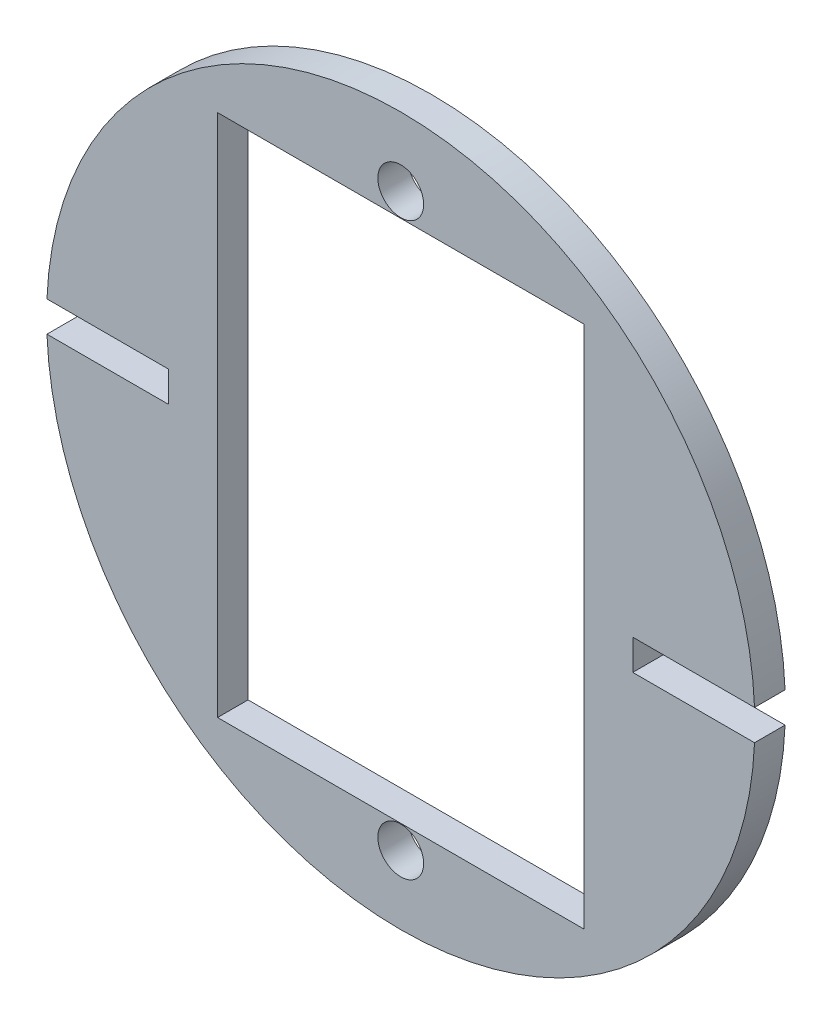
ISO-10303-21;
HEADER;
FILE_DESCRIPTION(('STEP AP214'),'2;1');
FILE_NAME('part.step','',(''),(''),'','','');
FILE_SCHEMA(('AUTOMOTIVE_DESIGN { 1 0 10303 214 1 1 1 1 }'));
ENDSEC;
DATA;
#1=APPLICATION_CONTEXT('core data for automotive mechanical design processes');
#2=APPLICATION_PROTOCOL_DEFINITION('international standard','automotive_design',2000,#1);
#3=PRODUCT_CONTEXT('',#1,'mechanical');
#4=PRODUCT('Part','Part','',(#3));
#5=PRODUCT_RELATED_PRODUCT_CATEGORY('part','',(#4));
#6=PRODUCT_DEFINITION_FORMATION('','',#4);
#7=PRODUCT_DEFINITION_CONTEXT('part definition',#1,'design');
#8=PRODUCT_DEFINITION('design','',#6,#7);
#9=PRODUCT_DEFINITION_SHAPE('','',#8);
#10=(LENGTH_UNIT() NAMED_UNIT(*) SI_UNIT(.MILLI.,.METRE.));
#11=(NAMED_UNIT(*) PLANE_ANGLE_UNIT() SI_UNIT($,.RADIAN.));
#12=(NAMED_UNIT(*) SI_UNIT($,.STERADIAN.) SOLID_ANGLE_UNIT());
#13=UNCERTAINTY_MEASURE_WITH_UNIT(LENGTH_MEASURE(1.E-05),#10,'distance_accuracy_value','');
#14=(GEOMETRIC_REPRESENTATION_CONTEXT(3) GLOBAL_UNCERTAINTY_ASSIGNED_CONTEXT((#13)) GLOBAL_UNIT_ASSIGNED_CONTEXT((#10,
#11,#12)) REPRESENTATION_CONTEXT('',''));
#15=CARTESIAN_POINT('',(0.,0.,0.));
#16=DIRECTION('',(0.,0.,1.));
#17=DIRECTION('',(1.,0.,0.));
#18=AXIS2_PLACEMENT_3D('',#15,#16,#17);
#19=CARTESIAN_POINT('',(0.,0.,6.35));
#20=DIRECTION('',(0.,0.,1.));
#21=DIRECTION('',(1.,0.,0.));
#22=AXIS2_PLACEMENT_3D('',#19,#20,#21);
#23=PLANE('',#22);
#24=DIRECTION('',(-1.,0.,0.));
#25=VECTOR('',#24,1.);
#26=CARTESIAN_POINT('',(38.1,-54.483,6.35));
#27=LINE('',#26,#25);
#28=CARTESIAN_POINT('',(38.1,-54.483,6.35));
#29=VERTEX_POINT('',#28);
#30=CARTESIAN_POINT('',(-38.1,-54.483,6.35));
#31=VERTEX_POINT('',#30);
#32=EDGE_CURVE('E142',#29,#31,#27,.T.);
#33=ORIENTED_EDGE('',*,*,#32,.T.);
#34=DIRECTION('',(0.,1.,0.));
#35=VECTOR('',#34,1.);
#36=CARTESIAN_POINT('',(-38.1,54.483,6.35));
#37=LINE('',#36,#35);
#38=CARTESIAN_POINT('',(-38.1,54.483,6.35));
#39=VERTEX_POINT('',#38);
#40=EDGE_CURVE('E152',#31,#39,#37,.T.);
#41=ORIENTED_EDGE('',*,*,#40,.T.);
#42=DIRECTION('',(1.,0.,0.));
#43=VECTOR('',#42,1.);
#44=CARTESIAN_POINT('',(38.1,54.483,6.35));
#45=LINE('',#44,#43);
#46=CARTESIAN_POINT('',(38.1,54.483,6.35));
#47=VERTEX_POINT('',#46);
#48=EDGE_CURVE('E66',#39,#47,#45,.T.);
#49=ORIENTED_EDGE('',*,*,#48,.T.);
#50=DIRECTION('',(0.,-1.,0.));
#51=VECTOR('',#50,1.);
#52=CARTESIAN_POINT('',(38.1,54.483,6.35));
#53=LINE('',#52,#51);
#54=EDGE_CURVE('E149',#47,#29,#53,.T.);
#55=ORIENTED_EDGE('',*,*,#54,.T.);
#56=EDGE_LOOP('',(#33,#41,#49,#55));
#57=FACE_BOUND('',#56,.T.);
#58=CARTESIAN_POINT('',(0.,59.3725,6.35));
#59=DIRECTION('',(0.,0.,-1.));
#60=DIRECTION('',(-1.,0.,0.));
#61=AXIS2_PLACEMENT_3D('',#58,#59,#60);
#62=CIRCLE('',#61,4.7625);
#63=CARTESIAN_POINT('',(-4.7625,59.3725,6.35));
#64=VERTEX_POINT('',#63);
#65=EDGE_CURVE('E182',#64,#64,#62,.F.);
#66=ORIENTED_EDGE('',*,*,#65,.F.);
#67=EDGE_LOOP('',(#66));
#68=FACE_BOUND('',#67,.T.);
#69=DIRECTION('',(-1.,0.,0.));
#70=VECTOR('',#69,1.);
#71=CARTESIAN_POINT('',(76.2,-3.17500000000001,6.35));
#72=LINE('',#71,#70);
#73=CARTESIAN_POINT('',(73.5915414636764,-3.17500000000001,6.35));
#74=VERTEX_POINT('',#73);
#75=CARTESIAN_POINT('',(48.26,-3.17500000000001,6.35));
#76=VERTEX_POINT('',#75);
#77=EDGE_CURVE('E213',#74,#76,#72,.T.);
#78=ORIENTED_EDGE('',*,*,#77,.T.);
#79=DIRECTION('',(0.,1.,0.));
#80=VECTOR('',#79,1.);
#81=CARTESIAN_POINT('',(48.26,-3.17500000000001,6.35));
#82=LINE('',#81,#80);
#83=CARTESIAN_POINT('',(48.26,3.175,6.35));
#84=VERTEX_POINT('',#83);
#85=EDGE_CURVE('E204',#76,#84,#82,.T.);
#86=ORIENTED_EDGE('',*,*,#85,.T.);
#87=DIRECTION('',(1.,0.,0.));
#88=VECTOR('',#87,1.);
#89=CARTESIAN_POINT('',(48.26,3.175,6.35));
#90=LINE('',#89,#88);
#91=CARTESIAN_POINT('',(73.5915414636764,3.17499999999999,6.35));
#92=VERTEX_POINT('',#91);
#93=EDGE_CURVE('E208',#84,#92,#90,.T.);
#94=ORIENTED_EDGE('',*,*,#93,.T.);
#95=CARTESIAN_POINT('',(0.,0.,6.35));
#96=DIRECTION('',(0.,0.,1.));
#97=DIRECTION('',(1.,0.,0.));
#98=AXIS2_PLACEMENT_3D('',#95,#96,#97);
#99=CIRCLE('',#98,73.66);
#100=CARTESIAN_POINT('',(-73.5915414636764,3.17500000000001,6.35));
#101=VERTEX_POINT('',#100);
#102=EDGE_CURVE('E271',#92,#101,#99,.T.);
#103=ORIENTED_EDGE('',*,*,#102,.T.);
#104=DIRECTION('',(1.,0.,0.));
#105=VECTOR('',#104,1.);
#106=CARTESIAN_POINT('',(-48.26,3.17500000000001,6.35));
#107=LINE('',#106,#105);
#108=CARTESIAN_POINT('',(-48.26,3.17500000000001,6.35));
#109=VERTEX_POINT('',#108);
#110=EDGE_CURVE('E248',#101,#109,#107,.T.);
#111=ORIENTED_EDGE('',*,*,#110,.T.);
#112=DIRECTION('',(0.,-1.,0.));
#113=VECTOR('',#112,1.);
#114=CARTESIAN_POINT('',(-48.26,0.,6.35));
#115=LINE('',#114,#113);
#116=CARTESIAN_POINT('',(-48.26,-3.175,6.35));
#117=VERTEX_POINT('',#116);
#118=EDGE_CURVE('E235',#109,#117,#115,.T.);
#119=ORIENTED_EDGE('',*,*,#118,.T.);
#120=DIRECTION('',(-1.,0.,0.));
#121=VECTOR('',#120,1.);
#122=CARTESIAN_POINT('',(-76.2,-3.17499999999999,6.35));
#123=LINE('',#122,#121);
#124=CARTESIAN_POINT('',(-73.5915414636764,-3.17499999999999,6.35));
#125=VERTEX_POINT('',#124);
#126=EDGE_CURVE('E242',#117,#125,#123,.T.);
#127=ORIENTED_EDGE('',*,*,#126,.T.);
#128=EDGE_CURVE('E275',#125,#74,#99,.T.);
#129=ORIENTED_EDGE('',*,*,#128,.T.);
#130=EDGE_LOOP('',(#78,#86,#94,#103,#111,#119,#127,#129));
#131=FACE_BOUND('',#130,.T.);
#132=CARTESIAN_POINT('',(0.,-59.3725,6.35));
#133=DIRECTION('',(0.,0.,-1.));
#134=DIRECTION('',(-1.,0.,0.));
#135=AXIS2_PLACEMENT_3D('',#132,#133,#134);
#136=CIRCLE('',#135,4.7625);
#137=CARTESIAN_POINT('',(-4.7625,-59.3725,6.35));
#138=VERTEX_POINT('',#137);
#139=EDGE_CURVE('E188',#138,#138,#136,.T.);
#140=ORIENTED_EDGE('',*,*,#139,.T.);
#141=EDGE_LOOP('',(#140));
#142=FACE_BOUND('',#141,.T.);
#143=ADVANCED_FACE('F50',(#57,#68,#131,#142),#23,.T.);
#144=CARTESIAN_POINT('',(0.,0.,0.));
#145=DIRECTION('',(0.,0.,1.));
#146=DIRECTION('',(1.,0.,0.));
#147=AXIS2_PLACEMENT_3D('',#144,#145,#146);
#148=PLANE('',#147);
#149=DIRECTION('',(0.,1.,0.));
#150=VECTOR('',#149,1.);
#151=CARTESIAN_POINT('',(-38.1,54.483,0.));
#152=LINE('',#151,#150);
#153=CARTESIAN_POINT('',(-38.1,-54.483,0.));
#154=VERTEX_POINT('',#153);
#155=CARTESIAN_POINT('',(-38.1,54.483,0.));
#156=VERTEX_POINT('',#155);
#157=EDGE_CURVE('E173',#154,#156,#152,.T.);
#158=ORIENTED_EDGE('',*,*,#157,.F.);
#159=DIRECTION('',(-1.,0.,0.));
#160=VECTOR('',#159,1.);
#161=CARTESIAN_POINT('',(38.1,-54.483,0.));
#162=LINE('',#161,#160);
#163=CARTESIAN_POINT('',(38.1,-54.483,0.));
#164=VERTEX_POINT('',#163);
#165=EDGE_CURVE('E74',#164,#154,#162,.T.);
#166=ORIENTED_EDGE('',*,*,#165,.F.);
#167=DIRECTION('',(0.,-1.,0.));
#168=VECTOR('',#167,1.);
#169=CARTESIAN_POINT('',(38.1,54.483,0.));
#170=LINE('',#169,#168);
#171=CARTESIAN_POINT('',(38.1,54.483,0.));
#172=VERTEX_POINT('',#171);
#173=EDGE_CURVE('E160',#172,#164,#170,.T.);
#174=ORIENTED_EDGE('',*,*,#173,.F.);
#175=DIRECTION('',(1.,0.,0.));
#176=VECTOR('',#175,1.);
#177=CARTESIAN_POINT('',(38.1,54.483,0.));
#178=LINE('',#177,#176);
#179=EDGE_CURVE('E164',#156,#172,#178,.T.);
#180=ORIENTED_EDGE('',*,*,#179,.F.);
#181=EDGE_LOOP('',(#158,#166,#174,#180));
#182=FACE_BOUND('',#181,.T.);
#183=DIRECTION('',(0.,1.,0.));
#184=VECTOR('',#183,1.);
#185=CARTESIAN_POINT('',(48.26,0.,0.));
#186=LINE('',#185,#184);
#187=CARTESIAN_POINT('',(48.26,-3.17500000000001,0.));
#188=VERTEX_POINT('',#187);
#189=CARTESIAN_POINT('',(48.26,3.175,0.));
#190=VERTEX_POINT('',#189);
#191=EDGE_CURVE('E218',#188,#190,#186,.T.);
#192=ORIENTED_EDGE('',*,*,#191,.F.);
#193=DIRECTION('',(1.,0.,0.));
#194=VECTOR('',#193,1.);
#195=CARTESIAN_POINT('',(0.,-3.17500000000001,0.));
#196=LINE('',#195,#194);
#197=CARTESIAN_POINT('',(73.5915414636764,-3.17500000000001,0.));
#198=VERTEX_POINT('',#197);
#199=EDGE_CURVE('E12',#188,#198,#196,.T.);
#200=ORIENTED_EDGE('',*,*,#199,.T.);
#201=CARTESIAN_POINT('',(0.,0.,0.));
#202=DIRECTION('',(0.,0.,1.));
#203=DIRECTION('',(1.,0.,0.));
#204=AXIS2_PLACEMENT_3D('',#201,#202,#203);
#205=CIRCLE('',#204,73.66);
#206=CARTESIAN_POINT('',(-73.5915414636764,-3.17499999999999,0.));
#207=VERTEX_POINT('',#206);
#208=EDGE_CURVE('E270',#207,#198,#205,.T.);
#209=ORIENTED_EDGE('',*,*,#208,.F.);
#210=DIRECTION('',(-1.,0.,0.));
#211=VECTOR('',#210,1.);
#212=CARTESIAN_POINT('',(-76.2,-3.17499999999999,0.));
#213=LINE('',#212,#211);
#214=CARTESIAN_POINT('',(-48.26,-3.175,0.));
#215=VERTEX_POINT('',#214);
#216=EDGE_CURVE('E222',#215,#207,#213,.T.);
#217=ORIENTED_EDGE('',*,*,#216,.F.);
#218=DIRECTION('',(0.,-1.,0.));
#219=VECTOR('',#218,1.);
#220=CARTESIAN_POINT('',(-48.26,-3.175,0.));
#221=LINE('',#220,#219);
#222=CARTESIAN_POINT('',(-48.26,3.17500000000001,0.));
#223=VERTEX_POINT('',#222);
#224=EDGE_CURVE('E238',#223,#215,#221,.T.);
#225=ORIENTED_EDGE('',*,*,#224,.F.);
#226=DIRECTION('',(-1.,0.,0.));
#227=VECTOR('',#226,1.);
#228=CARTESIAN_POINT('',(0.,3.175,0.));
#229=LINE('',#228,#227);
#230=CARTESIAN_POINT('',(-73.5915414636764,3.17500000000001,0.));
#231=VERTEX_POINT('',#230);
#232=EDGE_CURVE('E59',#223,#231,#229,.T.);
#233=ORIENTED_EDGE('',*,*,#232,.T.);
#234=CARTESIAN_POINT('',(73.5915414636764,3.17499999999999,0.));
#235=VERTEX_POINT('',#234);
#236=EDGE_CURVE('E276',#235,#231,#205,.T.);
#237=ORIENTED_EDGE('',*,*,#236,.F.);
#238=DIRECTION('',(1.,0.,0.));
#239=VECTOR('',#238,1.);
#240=CARTESIAN_POINT('',(48.26,3.175,0.));
#241=LINE('',#240,#239);
#242=EDGE_CURVE('E209',#190,#235,#241,.T.);
#243=ORIENTED_EDGE('',*,*,#242,.F.);
#244=EDGE_LOOP('',(#192,#200,#209,#217,#225,#233,#237,#243));
#245=FACE_BOUND('',#244,.T.);
#246=CARTESIAN_POINT('',(0.,59.3725,0.));
#247=DIRECTION('',(0.,0.,-1.));
#248=DIRECTION('',(-1.,0.,0.));
#249=AXIS2_PLACEMENT_3D('',#246,#247,#248);
#250=CIRCLE('',#249,4.7625);
#251=CARTESIAN_POINT('',(-4.7625,59.3725,0.));
#252=VERTEX_POINT('',#251);
#253=EDGE_CURVE('E197',#252,#252,#250,.F.);
#254=ORIENTED_EDGE('',*,*,#253,.T.);
#255=EDGE_LOOP('',(#254));
#256=FACE_BOUND('',#255,.T.);
#257=CARTESIAN_POINT('',(0.,-59.3725,0.));
#258=DIRECTION('',(0.,0.,-1.));
#259=DIRECTION('',(-1.,0.,0.));
#260=AXIS2_PLACEMENT_3D('',#257,#258,#259);
#261=CIRCLE('',#260,4.7625);
#262=CARTESIAN_POINT('',(-4.7625,-59.3725,0.));
#263=VERTEX_POINT('',#262);
#264=EDGE_CURVE('E193',#263,#263,#261,.T.);
#265=ORIENTED_EDGE('',*,*,#264,.F.);
#266=EDGE_LOOP('',(#265));
#267=FACE_BOUND('',#266,.T.);
#268=ADVANCED_FACE('F285',(#182,#245,#256,#267),#148,.F.);
#269=CARTESIAN_POINT('',(0.,0.,6.35));
#270=DIRECTION('',(0.,0.,-1.));
#271=DIRECTION('',(-1.,0.,0.));
#272=AXIS2_PLACEMENT_3D('',#269,#270,#271);
#273=CYLINDRICAL_SURFACE('',#272,73.66);
#274=ORIENTED_EDGE('',*,*,#208,.T.);
#275=DIRECTION('',(0.,0.,-1.));
#276=VECTOR('',#275,1.);
#277=CARTESIAN_POINT('',(73.5915414636764,-3.17500000000001,6.35));
#278=LINE('',#277,#276);
#279=EDGE_CURVE('E266',#198,#74,#278,.F.);
#280=ORIENTED_EDGE('',*,*,#279,.T.);
#281=ORIENTED_EDGE('',*,*,#128,.F.);
#282=DIRECTION('',(0.,0.,-1.));
#283=VECTOR('',#282,1.);
#284=CARTESIAN_POINT('',(-73.5915414636764,-3.17499999999999,6.35));
#285=LINE('',#284,#283);
#286=EDGE_CURVE('E258',#125,#207,#285,.T.);
#287=ORIENTED_EDGE('',*,*,#286,.T.);
#288=EDGE_LOOP('',(#274,#280,#281,#287));
#289=FACE_BOUND('',#288,.T.);
#290=ADVANCED_FACE('F306',(#289),#273,.T.);
#291=ORIENTED_EDGE('',*,*,#102,.F.);
#292=DIRECTION('',(0.,0.,-1.));
#293=VECTOR('',#292,1.);
#294=CARTESIAN_POINT('',(73.5915414636764,3.17499999999999,6.35));
#295=LINE('',#294,#293);
#296=EDGE_CURVE('E262',#92,#235,#295,.T.);
#297=ORIENTED_EDGE('',*,*,#296,.T.);
#298=ORIENTED_EDGE('',*,*,#236,.T.);
#299=DIRECTION('',(0.,0.,-1.));
#300=VECTOR('',#299,1.);
#301=CARTESIAN_POINT('',(-73.5915414636764,3.17500000000001,6.35));
#302=LINE('',#301,#300);
#303=EDGE_CURVE('E228',#231,#101,#302,.F.);
#304=ORIENTED_EDGE('',*,*,#303,.T.);
#305=EDGE_LOOP('',(#291,#297,#298,#304));
#306=FACE_BOUND('',#305,.T.);
#307=ADVANCED_FACE('F52',(#306),#273,.T.);
#308=CARTESIAN_POINT('',(-76.2,-3.17499999999999,6.35));
#309=DIRECTION('',(0.,-1.,0.));
#310=DIRECTION('',(1.,0.,0.));
#311=AXIS2_PLACEMENT_3D('',#308,#309,#310);
#312=PLANE('',#311);
#313=ORIENTED_EDGE('',*,*,#126,.F.);
#314=DIRECTION('',(0.,0.,-1.));
#315=VECTOR('',#314,1.);
#316=CARTESIAN_POINT('',(-48.26,-3.175,6.35));
#317=LINE('',#316,#315);
#318=EDGE_CURVE('E192',#117,#215,#317,.T.);
#319=ORIENTED_EDGE('',*,*,#318,.T.);
#320=ORIENTED_EDGE('',*,*,#216,.T.);
#321=ORIENTED_EDGE('',*,*,#286,.F.);
#322=EDGE_LOOP('',(#313,#319,#320,#321));
#323=FACE_BOUND('',#322,.T.);
#324=ADVANCED_FACE('F313',(#323),#312,.F.);
#325=CARTESIAN_POINT('',(-48.26,3.17500000000001,6.35));
#326=DIRECTION('',(0.,1.,0.));
#327=DIRECTION('',(-1.,0.,0.));
#328=AXIS2_PLACEMENT_3D('',#325,#326,#327);
#329=PLANE('',#328);
#330=ORIENTED_EDGE('',*,*,#232,.F.);
#331=DIRECTION('',(0.,0.,-1.));
#332=VECTOR('',#331,1.);
#333=CARTESIAN_POINT('',(-48.26,3.17500000000001,6.35));
#334=LINE('',#333,#332);
#335=EDGE_CURVE('E231',#109,#223,#334,.T.);
#336=ORIENTED_EDGE('',*,*,#335,.F.);
#337=ORIENTED_EDGE('',*,*,#110,.F.);
#338=ORIENTED_EDGE('',*,*,#303,.F.);
#339=EDGE_LOOP('',(#330,#336,#337,#338));
#340=FACE_BOUND('',#339,.T.);
#341=ADVANCED_FACE('F316',(#340),#329,.F.);
#342=CARTESIAN_POINT('',(-48.26,-3.175,6.35));
#343=DIRECTION('',(1.,0.,0.));
#344=DIRECTION('',(0.,0.,-1.));
#345=AXIS2_PLACEMENT_3D('',#342,#343,#344);
#346=PLANE('',#345);
#347=ORIENTED_EDGE('',*,*,#224,.T.);
#348=ORIENTED_EDGE('',*,*,#318,.F.);
#349=ORIENTED_EDGE('',*,*,#118,.F.);
#350=ORIENTED_EDGE('',*,*,#335,.T.);
#351=EDGE_LOOP('',(#347,#348,#349,#350));
#352=FACE_BOUND('',#351,.T.);
#353=ADVANCED_FACE('F315',(#352),#346,.F.);
#354=CARTESIAN_POINT('',(76.2,-3.17500000000001,6.35));
#355=DIRECTION('',(0.,-1.,0.));
#356=DIRECTION('',(0.,0.,-1.));
#357=AXIS2_PLACEMENT_3D('',#354,#355,#356);
#358=PLANE('',#357);
#359=ORIENTED_EDGE('',*,*,#199,.F.);
#360=DIRECTION('',(0.,0.,-1.));
#361=VECTOR('',#360,1.);
#362=CARTESIAN_POINT('',(48.26,-3.17500000000001,6.35));
#363=LINE('',#362,#361);
#364=EDGE_CURVE('E225',#76,#188,#363,.T.);
#365=ORIENTED_EDGE('',*,*,#364,.F.);
#366=ORIENTED_EDGE('',*,*,#77,.F.);
#367=ORIENTED_EDGE('',*,*,#279,.F.);
#368=EDGE_LOOP('',(#359,#365,#366,#367));
#369=FACE_BOUND('',#368,.T.);
#370=ADVANCED_FACE('F323',(#369),#358,.F.);
#371=CARTESIAN_POINT('',(48.26,3.175,6.35));
#372=DIRECTION('',(0.,1.,0.));
#373=DIRECTION('',(-1.,0.,0.));
#374=AXIS2_PLACEMENT_3D('',#371,#372,#373);
#375=PLANE('',#374);
#376=ORIENTED_EDGE('',*,*,#93,.F.);
#377=DIRECTION('',(0.,0.,-1.));
#378=VECTOR('',#377,1.);
#379=CARTESIAN_POINT('',(48.26,3.175,6.35));
#380=LINE('',#379,#378);
#381=EDGE_CURVE('E217',#84,#190,#380,.T.);
#382=ORIENTED_EDGE('',*,*,#381,.T.);
#383=ORIENTED_EDGE('',*,*,#242,.T.);
#384=ORIENTED_EDGE('',*,*,#296,.F.);
#385=EDGE_LOOP('',(#376,#382,#383,#384));
#386=FACE_BOUND('',#385,.T.);
#387=ADVANCED_FACE('F294',(#386),#375,.F.);
#388=CARTESIAN_POINT('',(48.26,0.,6.35));
#389=DIRECTION('',(-1.,0.,0.));
#390=DIRECTION('',(0.,0.,1.));
#391=AXIS2_PLACEMENT_3D('',#388,#389,#390);
#392=PLANE('',#391);
#393=ORIENTED_EDGE('',*,*,#191,.T.);
#394=ORIENTED_EDGE('',*,*,#381,.F.);
#395=ORIENTED_EDGE('',*,*,#85,.F.);
#396=ORIENTED_EDGE('',*,*,#364,.T.);
#397=EDGE_LOOP('',(#393,#394,#395,#396));
#398=FACE_BOUND('',#397,.T.);
#399=ADVANCED_FACE('F300',(#398),#392,.F.);
#400=CARTESIAN_POINT('',(0.,59.3725,6.35));
#401=DIRECTION('',(0.,0.,-1.));
#402=DIRECTION('',(-1.,0.,0.));
#403=AXIS2_PLACEMENT_3D('',#400,#401,#402);
#404=CYLINDRICAL_SURFACE('',#403,4.7625);
#405=ORIENTED_EDGE('',*,*,#65,.T.);
#406=EDGE_LOOP('',(#405));
#407=FACE_BOUND('',#406,.T.);
#408=ORIENTED_EDGE('',*,*,#253,.F.);
#409=EDGE_LOOP('',(#408));
#410=FACE_BOUND('',#409,.T.);
#411=ADVANCED_FACE('F354',(#407,#410),#404,.F.);
#412=CARTESIAN_POINT('',(0.,-59.3725,6.35));
#413=DIRECTION('',(0.,0.,-1.));
#414=DIRECTION('',(-1.,0.,0.));
#415=AXIS2_PLACEMENT_3D('',#412,#413,#414);
#416=CYLINDRICAL_SURFACE('',#415,4.7625);
#417=ORIENTED_EDGE('',*,*,#139,.F.);
#418=EDGE_LOOP('',(#417));
#419=FACE_BOUND('',#418,.T.);
#420=ORIENTED_EDGE('',*,*,#264,.T.);
#421=EDGE_LOOP('',(#420));
#422=FACE_BOUND('',#421,.T.);
#423=ADVANCED_FACE('F348',(#419,#422),#416,.F.);
#424=CARTESIAN_POINT('',(38.1,-54.483,6.35));
#425=DIRECTION('',(0.,-1.,0.));
#426=DIRECTION('',(0.,0.,-1.));
#427=AXIS2_PLACEMENT_3D('',#424,#425,#426);
#428=PLANE('',#427);
#429=ORIENTED_EDGE('',*,*,#165,.T.);
#430=DIRECTION('',(0.,0.,-1.));
#431=VECTOR('',#430,1.);
#432=CARTESIAN_POINT('',(-38.1,-54.483,6.35));
#433=LINE('',#432,#431);
#434=EDGE_CURVE('E138',#31,#154,#433,.T.);
#435=ORIENTED_EDGE('',*,*,#434,.F.);
#436=ORIENTED_EDGE('',*,*,#32,.F.);
#437=DIRECTION('',(0.,0.,-1.));
#438=VECTOR('',#437,1.);
#439=CARTESIAN_POINT('',(38.1,-54.483,6.35));
#440=LINE('',#439,#438);
#441=EDGE_CURVE('E179',#29,#164,#440,.T.);
#442=ORIENTED_EDGE('',*,*,#441,.T.);
#443=EDGE_LOOP('',(#429,#435,#436,#442));
#444=FACE_BOUND('',#443,.T.);
#445=ADVANCED_FACE('F140',(#444),#428,.F.);
#446=CARTESIAN_POINT('',(38.1,54.483,6.35));
#447=DIRECTION('',(1.,0.,0.));
#448=DIRECTION('',(0.,0.,-1.));
#449=AXIS2_PLACEMENT_3D('',#446,#447,#448);
#450=PLANE('',#449);
#451=ORIENTED_EDGE('',*,*,#173,.T.);
#452=ORIENTED_EDGE('',*,*,#441,.F.);
#453=ORIENTED_EDGE('',*,*,#54,.F.);
#454=DIRECTION('',(0.,0.,-1.));
#455=VECTOR('',#454,1.);
#456=CARTESIAN_POINT('',(38.1,54.483,6.35));
#457=LINE('',#456,#455);
#458=EDGE_CURVE('E183',#47,#172,#457,.T.);
#459=ORIENTED_EDGE('',*,*,#458,.T.);
#460=EDGE_LOOP('',(#451,#452,#453,#459));
#461=FACE_BOUND('',#460,.T.);
#462=ADVANCED_FACE('F341',(#461),#450,.F.);
#463=CARTESIAN_POINT('',(38.1,54.483,6.35));
#464=DIRECTION('',(0.,1.,0.));
#465=DIRECTION('',(0.,0.,1.));
#466=AXIS2_PLACEMENT_3D('',#463,#464,#465);
#467=PLANE('',#466);
#468=ORIENTED_EDGE('',*,*,#179,.T.);
#469=ORIENTED_EDGE('',*,*,#458,.F.);
#470=ORIENTED_EDGE('',*,*,#48,.F.);
#471=DIRECTION('',(0.,0.,-1.));
#472=VECTOR('',#471,1.);
#473=CARTESIAN_POINT('',(-38.1,54.483,6.35));
#474=LINE('',#473,#472);
#475=EDGE_CURVE('E148',#39,#156,#474,.T.);
#476=ORIENTED_EDGE('',*,*,#475,.T.);
#477=EDGE_LOOP('',(#468,#469,#470,#476));
#478=FACE_BOUND('',#477,.T.);
#479=ADVANCED_FACE('F339',(#478),#467,.F.);
#480=CARTESIAN_POINT('',(-38.1,54.483,6.35));
#481=DIRECTION('',(-1.,0.,0.));
#482=DIRECTION('',(0.,0.,1.));
#483=AXIS2_PLACEMENT_3D('',#480,#481,#482);
#484=PLANE('',#483);
#485=ORIENTED_EDGE('',*,*,#157,.T.);
#486=ORIENTED_EDGE('',*,*,#475,.F.);
#487=ORIENTED_EDGE('',*,*,#40,.F.);
#488=ORIENTED_EDGE('',*,*,#434,.T.);
#489=EDGE_LOOP('',(#485,#486,#487,#488));
#490=FACE_BOUND('',#489,.T.);
#491=ADVANCED_FACE('F153',(#490),#484,.F.);
#492=CLOSED_SHELL('',(#143,#268,#290,#307,#324,#341,#353,#370,#387,#399,#411,#423,#445,#462,
#479,#491));
#493=MANIFOLD_SOLID_BREP('B2',#492);
#494=ADVANCED_BREP_SHAPE_REPRESENTATION('',(#18,#493),#14);
#495=SHAPE_DEFINITION_REPRESENTATION(#9,#494);
ENDSEC;
END-ISO-10303-21;
